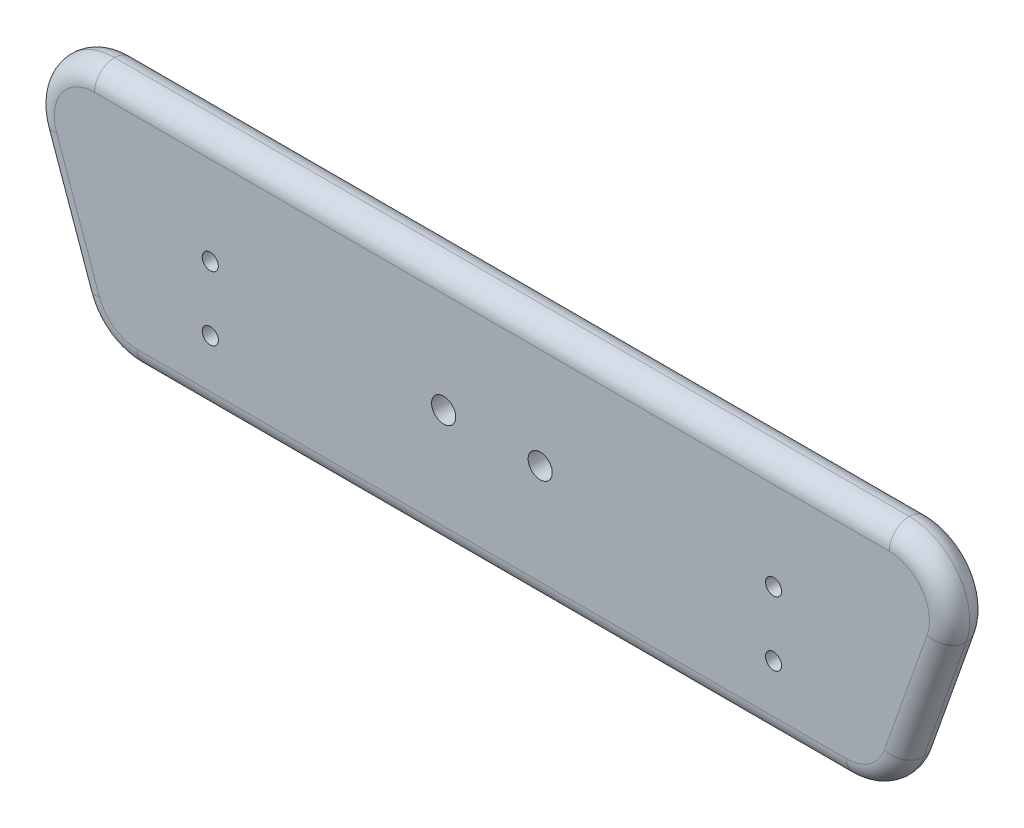
ISO-10303-21;
HEADER;
FILE_DESCRIPTION(('STEP AP214'),'2;1');
FILE_NAME('part.step','',(''),(''),'','','');
FILE_SCHEMA(('AUTOMOTIVE_DESIGN { 1 0 10303 214 1 1 1 1 }'));
ENDSEC;
DATA;
#1=APPLICATION_CONTEXT('core data for automotive mechanical design processes');
#2=APPLICATION_PROTOCOL_DEFINITION('international standard','automotive_design',2000,#1);
#3=PRODUCT_CONTEXT('',#1,'mechanical');
#4=PRODUCT('Part','Part','',(#3));
#5=PRODUCT_RELATED_PRODUCT_CATEGORY('part','',(#4));
#6=PRODUCT_DEFINITION_FORMATION('','',#4);
#7=PRODUCT_DEFINITION_CONTEXT('part definition',#1,'design');
#8=PRODUCT_DEFINITION('design','',#6,#7);
#9=PRODUCT_DEFINITION_SHAPE('','',#8);
#10=(LENGTH_UNIT() NAMED_UNIT(*) SI_UNIT(.MILLI.,.METRE.));
#11=(NAMED_UNIT(*) PLANE_ANGLE_UNIT() SI_UNIT($,.RADIAN.));
#12=(NAMED_UNIT(*) SI_UNIT($,.STERADIAN.) SOLID_ANGLE_UNIT());
#13=UNCERTAINTY_MEASURE_WITH_UNIT(LENGTH_MEASURE(1.E-05),#10,'distance_accuracy_value','');
#14=(GEOMETRIC_REPRESENTATION_CONTEXT(3) GLOBAL_UNCERTAINTY_ASSIGNED_CONTEXT((#13)) GLOBAL_UNIT_ASSIGNED_CONTEXT((#10,
#11,#12)) REPRESENTATION_CONTEXT('',''));
#15=CARTESIAN_POINT('',(0.,0.,0.));
#16=DIRECTION('',(0.,0.,1.));
#17=DIRECTION('',(1.,0.,0.));
#18=AXIS2_PLACEMENT_3D('',#15,#16,#17);
#19=CARTESIAN_POINT('',(0.,0.,10.));
#20=DIRECTION('',(0.,0.,-1.));
#21=DIRECTION('',(-1.,0.,0.));
#22=AXIS2_PLACEMENT_3D('',#19,#20,#21);
#23=PLANE('',#22);
#24=DIRECTION('',(0.333806859233775,0.942641491092177,0.));
#25=VECTOR('',#24,1.);
#26=CARTESIAN_POINT('',(97.3084687272462,-34.458736040841,10.));
#27=LINE('',#26,#25);
#28=CARTESIAN_POINT('',(93.6321603124579,-44.8403107448041,10.));
#29=VERTEX_POINT('',#28);
#30=CARTESIAN_POINT('',(104.255717488379,-14.8403107448042,10.));
#31=VERTEX_POINT('',#30);
#32=EDGE_CURVE('E239',#29,#31,#27,.T.);
#33=ORIENTED_EDGE('',*,*,#32,.T.);
#34=CARTESIAN_POINT('',(94.8293025774572,-11.5022421524664,10.));
#35=DIRECTION('',(0.,0.,-1.));
#36=DIRECTION('',(-1.,0.,0.));
#37=AXIS2_PLACEMENT_3D('',#34,#35,#36);
#38=CIRCLE('',#37,10.);
#39=CARTESIAN_POINT('',(94.8293025774572,-1.50224215246638,10.));
#40=VERTEX_POINT('',#39);
#41=EDGE_CURVE('E236',#31,#40,#38,.F.);
#42=ORIENTED_EDGE('',*,*,#41,.T.);
#43=DIRECTION('',(-1.,0.,0.));
#44=VECTOR('',#43,1.);
#45=CARTESIAN_POINT('',(0.,-1.50224215246638,10.));
#46=LINE('',#45,#44);
#47=CARTESIAN_POINT('',(-102.721679259072,-1.50224215246638,10.));
#48=VERTEX_POINT('',#47);
#49=EDGE_CURVE('E163',#40,#48,#46,.T.);
#50=ORIENTED_EDGE('',*,*,#49,.T.);
#51=CARTESIAN_POINT('',(-102.721679259072,-11.5022421524664,10.));
#52=DIRECTION('',(0.,0.,-1.));
#53=DIRECTION('',(-1.,0.,0.));
#54=AXIS2_PLACEMENT_3D('',#51,#52,#53);
#55=CIRCLE('',#54,10.);
#56=CARTESIAN_POINT('',(-112.148094169994,-14.8403107448041,10.));
#57=VERTEX_POINT('',#56);
#58=EDGE_CURVE('E165',#48,#57,#55,.F.);
#59=ORIENTED_EDGE('',*,*,#58,.T.);
#60=DIRECTION('',(0.333806859233768,-0.942641491092179,0.));
#61=VECTOR('',#60,1.);
#62=CARTESIAN_POINT('',(-104.321421400261,-36.9421528306335,10.));
#63=LINE('',#62,#61);
#64=CARTESIAN_POINT('',(-101.524536994073,-44.8403107448041,10.));
#65=VERTEX_POINT('',#64);
#66=EDGE_CURVE('E247',#57,#65,#63,.T.);
#67=ORIENTED_EDGE('',*,*,#66,.T.);
#68=CARTESIAN_POINT('',(-92.098122083151,-41.5022421524664,10.));
#69=DIRECTION('',(0.,0.,-1.));
#70=DIRECTION('',(-1.,0.,0.));
#71=AXIS2_PLACEMENT_3D('',#68,#69,#70);
#72=CIRCLE('',#71,10.);
#73=CARTESIAN_POINT('',(-92.098122083151,-51.5022421524664,10.));
#74=VERTEX_POINT('',#73);
#75=EDGE_CURVE('E245',#65,#74,#72,.F.);
#76=ORIENTED_EDGE('',*,*,#75,.T.);
#77=DIRECTION('',(1.,0.,0.));
#78=VECTOR('',#77,1.);
#79=CARTESIAN_POINT('',(0.,-51.5022421524664,10.));
#80=LINE('',#79,#78);
#81=CARTESIAN_POINT('',(84.2057454015362,-51.5022421524664,10.));
#82=VERTEX_POINT('',#81);
#83=EDGE_CURVE('E243',#74,#82,#80,.T.);
#84=ORIENTED_EDGE('',*,*,#83,.T.);
#85=CARTESIAN_POINT('',(84.2057454015362,-41.5022421524664,10.));
#86=DIRECTION('',(0.,0.,-1.));
#87=DIRECTION('',(-1.,0.,0.));
#88=AXIS2_PLACEMENT_3D('',#85,#86,#87);
#89=CIRCLE('',#88,10.);
#90=EDGE_CURVE('E241',#82,#29,#89,.F.);
#91=ORIENTED_EDGE('',*,*,#90,.T.);
#92=EDGE_LOOP('',(#33,#42,#50,#59,#67,#76,#84,#91));
#93=FACE_BOUND('',#92,.T.);
#94=CARTESIAN_POINT('',(-73.9461883408073,-23.5022421524664,10.));
#95=DIRECTION('',(0.,0.,1.));
#96=DIRECTION('',(1.,0.,0.));
#97=AXIS2_PLACEMENT_3D('',#94,#95,#96);
#98=CIRCLE('',#97,2.);
#99=CARTESIAN_POINT('',(-71.9461883408073,-23.5022421524664,10.));
#100=VERTEX_POINT('',#99);
#101=EDGE_CURVE('E250',#100,#100,#98,.T.);
#102=ORIENTED_EDGE('',*,*,#101,.F.);
#103=EDGE_LOOP('',(#102));
#104=FACE_BOUND('',#103,.T.);
#105=CARTESIAN_POINT('',(-73.9461883408073,-39.5022421524664,10.));
#106=DIRECTION('',(0.,0.,1.));
#107=DIRECTION('',(1.,0.,0.));
#108=AXIS2_PLACEMENT_3D('',#105,#106,#107);
#109=CIRCLE('',#108,2.);
#110=CARTESIAN_POINT('',(-71.9461883408073,-39.5022421524664,10.));
#111=VERTEX_POINT('',#110);
#112=EDGE_CURVE('E269',#111,#111,#109,.T.);
#113=ORIENTED_EDGE('',*,*,#112,.F.);
#114=EDGE_LOOP('',(#113));
#115=FACE_BOUND('',#114,.T.);
#116=CARTESIAN_POINT('',(66.0538116591926,-39.5022421524665,10.));
#117=DIRECTION('',(0.,0.,1.));
#118=DIRECTION('',(-1.,0.,0.));
#119=AXIS2_PLACEMENT_3D('',#116,#117,#118);
#120=CIRCLE('',#119,2.);
#121=CARTESIAN_POINT('',(64.0538116591926,-39.5022421524665,10.));
#122=VERTEX_POINT('',#121);
#123=EDGE_CURVE('E263',#122,#122,#120,.T.);
#124=ORIENTED_EDGE('',*,*,#123,.F.);
#125=EDGE_LOOP('',(#124));
#126=FACE_BOUND('',#125,.T.);
#127=CARTESIAN_POINT('',(66.0538116591927,-23.5022421524665,10.));
#128=DIRECTION('',(0.,0.,1.));
#129=DIRECTION('',(-1.,0.,0.));
#130=AXIS2_PLACEMENT_3D('',#127,#128,#129);
#131=CIRCLE('',#130,2.);
#132=CARTESIAN_POINT('',(64.0538116591927,-23.5022421524665,10.));
#133=VERTEX_POINT('',#132);
#134=EDGE_CURVE('E256',#133,#133,#131,.T.);
#135=ORIENTED_EDGE('',*,*,#134,.F.);
#136=EDGE_LOOP('',(#135));
#137=FACE_BOUND('',#136,.T.);
#138=CARTESIAN_POINT('',(8.05381165919268,-26.5022421524664,10.));
#139=DIRECTION('',(0.,0.,1.));
#140=DIRECTION('',(1.,0.,0.));
#141=AXIS2_PLACEMENT_3D('',#138,#139,#140);
#142=CIRCLE('',#141,3.);
#143=CARTESIAN_POINT('',(11.0538116591927,-26.5022421524664,10.));
#144=VERTEX_POINT('',#143);
#145=EDGE_CURVE('E306',#144,#144,#142,.T.);
#146=ORIENTED_EDGE('',*,*,#145,.F.);
#147=EDGE_LOOP('',(#146));
#148=FACE_BOUND('',#147,.T.);
#149=CARTESIAN_POINT('',(-15.9461883408073,-26.5022421524664,10.));
#150=DIRECTION('',(0.,0.,-1.));
#151=DIRECTION('',(-1.,0.,0.));
#152=AXIS2_PLACEMENT_3D('',#149,#150,#151);
#153=CIRCLE('',#152,3.);
#154=CARTESIAN_POINT('',(-18.9461883408073,-26.5022421524664,10.));
#155=VERTEX_POINT('',#154);
#156=EDGE_CURVE('E295',#155,#155,#153,.T.);
#157=ORIENTED_EDGE('',*,*,#156,.T.);
#158=EDGE_LOOP('',(#157));
#159=FACE_BOUND('',#158,.T.);
#160=ADVANCED_FACE('F38',(#93,#104,#115,#126,#137,#148,#159),#23,.F.);
#161=CARTESIAN_POINT('',(0.,0.,4.));
#162=DIRECTION('',(0.,0.,-1.));
#163=DIRECTION('',(-1.,0.,0.));
#164=AXIS2_PLACEMENT_3D('',#161,#162,#163);
#165=PLANE('',#164);
#166=CARTESIAN_POINT('',(8.05381165919268,-26.5022421524664,4.));
#167=DIRECTION('',(0.,0.,1.));
#168=DIRECTION('',(1.,0.,0.));
#169=AXIS2_PLACEMENT_3D('',#166,#167,#168);
#170=CIRCLE('',#169,3.);
#171=CARTESIAN_POINT('',(11.0538116591927,-26.5022421524664,4.));
#172=VERTEX_POINT('',#171);
#173=EDGE_CURVE('E309',#172,#172,#170,.T.);
#174=ORIENTED_EDGE('',*,*,#173,.T.);
#175=EDGE_LOOP('',(#174));
#176=FACE_BOUND('',#175,.T.);
#177=DIRECTION('',(-1.,0.,0.));
#178=VECTOR('',#177,1.);
#179=CARTESIAN_POINT('',(19.0538116591927,-6.50224215246637,4.));
#180=LINE('',#179,#178);
#181=CARTESIAN_POINT('',(19.0538116591927,-6.50224215246637,4.));
#182=VERTEX_POINT('',#181);
#183=CARTESIAN_POINT('',(-26.9461883408073,-6.50224215246637,4.));
#184=VERTEX_POINT('',#183);
#185=EDGE_CURVE('E287',#182,#184,#180,.T.);
#186=ORIENTED_EDGE('',*,*,#185,.F.);
#187=DIRECTION('',(0.,1.,0.));
#188=VECTOR('',#187,1.);
#189=CARTESIAN_POINT('',(19.0538116591927,-46.5022421524664,4.));
#190=LINE('',#189,#188);
#191=CARTESIAN_POINT('',(19.0538116591927,-46.5022421524664,4.));
#192=VERTEX_POINT('',#191);
#193=EDGE_CURVE('E283',#192,#182,#190,.T.);
#194=ORIENTED_EDGE('',*,*,#193,.F.);
#195=DIRECTION('',(-1.,0.,0.));
#196=VECTOR('',#195,1.);
#197=CARTESIAN_POINT('',(19.0538116591927,-46.5022421524664,4.));
#198=LINE('',#197,#196);
#199=CARTESIAN_POINT('',(-26.9461883408073,-46.5022421524664,4.));
#200=VERTEX_POINT('',#199);
#201=EDGE_CURVE('E298',#192,#200,#198,.T.);
#202=ORIENTED_EDGE('',*,*,#201,.T.);
#203=DIRECTION('',(0.,1.,0.));
#204=VECTOR('',#203,1.);
#205=CARTESIAN_POINT('',(-26.9461883408073,-46.5022421524664,4.));
#206=LINE('',#205,#204);
#207=EDGE_CURVE('E301',#200,#184,#206,.T.);
#208=ORIENTED_EDGE('',*,*,#207,.T.);
#209=EDGE_LOOP('',(#186,#194,#202,#208));
#210=FACE_BOUND('',#209,.T.);
#211=CARTESIAN_POINT('',(-15.9461883408073,-26.5022421524664,4.));
#212=DIRECTION('',(0.,0.,-1.));
#213=DIRECTION('',(-1.,0.,0.));
#214=AXIS2_PLACEMENT_3D('',#211,#212,#213);
#215=CIRCLE('',#214,3.);
#216=CARTESIAN_POINT('',(-18.9461883408073,-26.5022421524664,4.));
#217=VERTEX_POINT('',#216);
#218=EDGE_CURVE('E312',#217,#217,#215,.T.);
#219=ORIENTED_EDGE('',*,*,#218,.F.);
#220=EDGE_LOOP('',(#219));
#221=FACE_BOUND('',#220,.T.);
#222=ADVANCED_FACE('F326',(#176,#210,#221),#165,.T.);
#223=CARTESIAN_POINT('',(0.,0.,0.));
#224=DIRECTION('',(0.,0.,-1.));
#225=DIRECTION('',(-1.,0.,0.));
#226=AXIS2_PLACEMENT_3D('',#223,#224,#225);
#227=PLANE('',#226);
#228=DIRECTION('',(0.333806859233768,-0.942641491092179,0.));
#229=VECTOR('',#228,1.);
#230=CARTESIAN_POINT('',(-112.148094169994,-14.8403107448041,0.));
#231=LINE('',#230,#229);
#232=CARTESIAN_POINT('',(-101.524536994073,-44.8403107448041,0.));
#233=VERTEX_POINT('',#232);
#234=CARTESIAN_POINT('',(-112.148094169994,-14.8403107448041,0.));
#235=VERTEX_POINT('',#234);
#236=EDGE_CURVE('E47',#233,#235,#231,.F.);
#237=ORIENTED_EDGE('',*,*,#236,.T.);
#238=CARTESIAN_POINT('',(-102.721679259072,-11.5022421524664,0.));
#239=DIRECTION('',(0.,0.,-1.));
#240=DIRECTION('',(-1.,0.,0.));
#241=AXIS2_PLACEMENT_3D('',#238,#239,#240);
#242=CIRCLE('',#241,10.);
#243=CARTESIAN_POINT('',(-102.721679259072,-1.50224215246638,0.));
#244=VERTEX_POINT('',#243);
#245=EDGE_CURVE('E11',#235,#244,#242,.T.);
#246=ORIENTED_EDGE('',*,*,#245,.T.);
#247=DIRECTION('',(-1.,0.,0.));
#248=VECTOR('',#247,1.);
#249=CARTESIAN_POINT('',(94.8293025774572,-1.50224215246638,0.));
#250=LINE('',#249,#248);
#251=CARTESIAN_POINT('',(94.8293025774572,-1.50224215246638,0.));
#252=VERTEX_POINT('',#251);
#253=EDGE_CURVE('E234',#244,#252,#250,.F.);
#254=ORIENTED_EDGE('',*,*,#253,.T.);
#255=CARTESIAN_POINT('',(94.8293025774572,-11.5022421524664,0.));
#256=DIRECTION('',(0.,0.,-1.));
#257=DIRECTION('',(-1.,0.,0.));
#258=AXIS2_PLACEMENT_3D('',#255,#256,#257);
#259=CIRCLE('',#258,10.);
#260=CARTESIAN_POINT('',(104.255717488379,-14.8403107448041,0.));
#261=VERTEX_POINT('',#260);
#262=EDGE_CURVE('E232',#252,#261,#259,.T.);
#263=ORIENTED_EDGE('',*,*,#262,.T.);
#264=DIRECTION('',(0.333806859233775,0.942641491092177,0.));
#265=VECTOR('',#264,1.);
#266=CARTESIAN_POINT('',(93.6321603124579,-44.8403107448041,0.));
#267=LINE('',#266,#265);
#268=CARTESIAN_POINT('',(93.6321603124579,-44.8403107448041,0.));
#269=VERTEX_POINT('',#268);
#270=EDGE_CURVE('E230',#261,#269,#267,.F.);
#271=ORIENTED_EDGE('',*,*,#270,.T.);
#272=CARTESIAN_POINT('',(84.2057454015362,-41.5022421524664,0.));
#273=DIRECTION('',(0.,0.,-1.));
#274=DIRECTION('',(-1.,0.,0.));
#275=AXIS2_PLACEMENT_3D('',#272,#273,#274);
#276=CIRCLE('',#275,10.);
#277=CARTESIAN_POINT('',(84.2057454015362,-51.5022421524664,0.));
#278=VERTEX_POINT('',#277);
#279=EDGE_CURVE('E151',#269,#278,#276,.T.);
#280=ORIENTED_EDGE('',*,*,#279,.T.);
#281=DIRECTION('',(1.,0.,0.));
#282=VECTOR('',#281,1.);
#283=CARTESIAN_POINT('',(-92.098122083151,-51.5022421524664,0.));
#284=LINE('',#283,#282);
#285=CARTESIAN_POINT('',(-92.098122083151,-51.5022421524664,0.));
#286=VERTEX_POINT('',#285);
#287=EDGE_CURVE('E145',#278,#286,#284,.F.);
#288=ORIENTED_EDGE('',*,*,#287,.T.);
#289=CARTESIAN_POINT('',(-92.098122083151,-41.5022421524664,0.));
#290=DIRECTION('',(0.,0.,-1.));
#291=DIRECTION('',(-1.,0.,0.));
#292=AXIS2_PLACEMENT_3D('',#289,#290,#291);
#293=CIRCLE('',#292,10.);
#294=EDGE_CURVE('E148',#286,#233,#293,.T.);
#295=ORIENTED_EDGE('',*,*,#294,.T.);
#296=EDGE_LOOP('',(#237,#246,#254,#263,#271,#280,#288,#295));
#297=FACE_BOUND('',#296,.T.);
#298=DIRECTION('',(0.,1.,0.));
#299=VECTOR('',#298,1.);
#300=CARTESIAN_POINT('',(19.0538116591927,-46.5022421524664,0.));
#301=LINE('',#300,#299);
#302=CARTESIAN_POINT('',(19.0538116591927,-46.5022421524664,0.));
#303=VERTEX_POINT('',#302);
#304=CARTESIAN_POINT('',(19.0538116591927,-6.50224215246637,0.));
#305=VERTEX_POINT('',#304);
#306=EDGE_CURVE('E284',#303,#305,#301,.T.);
#307=ORIENTED_EDGE('',*,*,#306,.T.);
#308=DIRECTION('',(-1.,0.,0.));
#309=VECTOR('',#308,1.);
#310=CARTESIAN_POINT('',(19.0538116591927,-6.50224215246637,0.));
#311=LINE('',#310,#309);
#312=CARTESIAN_POINT('',(-26.9461883408073,-6.50224215246637,0.));
#313=VERTEX_POINT('',#312);
#314=EDGE_CURVE('E55',#305,#313,#311,.T.);
#315=ORIENTED_EDGE('',*,*,#314,.T.);
#316=DIRECTION('',(0.,1.,0.));
#317=VECTOR('',#316,1.);
#318=CARTESIAN_POINT('',(-26.9461883408073,-46.5022421524664,0.));
#319=LINE('',#318,#317);
#320=CARTESIAN_POINT('',(-26.9461883408073,-46.5022421524664,0.));
#321=VERTEX_POINT('',#320);
#322=EDGE_CURVE('E291',#321,#313,#319,.T.);
#323=ORIENTED_EDGE('',*,*,#322,.F.);
#324=DIRECTION('',(-1.,0.,0.));
#325=VECTOR('',#324,1.);
#326=CARTESIAN_POINT('',(19.0538116591927,-46.5022421524664,0.));
#327=LINE('',#326,#325);
#328=EDGE_CURVE('E288',#303,#321,#327,.T.);
#329=ORIENTED_EDGE('',*,*,#328,.F.);
#330=EDGE_LOOP('',(#307,#315,#323,#329));
#331=FACE_BOUND('',#330,.T.);
#332=ADVANCED_FACE('F146',(#297,#331),#227,.T.);
#333=CARTESIAN_POINT('',(-92.098122083151,-41.5022421524664,5.));
#334=DIRECTION('',(0.,0.,-1.));
#335=DIRECTION('',(-1.,0.,0.));
#336=AXIS2_PLACEMENT_3D('',#333,#334,#335);
#337=TOROIDAL_SURFACE('',#336,10.,5.);
#338=CARTESIAN_POINT('',(-101.524536994073,-44.8403107448041,5.));
#339=DIRECTION('',(-0.333806859233768,0.94264149109218,0.));
#340=DIRECTION('',(-0.94264149109218,-0.333806859233768,0.));
#341=AXIS2_PLACEMENT_3D('',#338,#339,#340);
#342=CIRCLE('',#341,5.);
#343=CARTESIAN_POINT('',(-106.237744449534,-46.5093450409729,5.));
#344=VERTEX_POINT('',#343);
#345=EDGE_CURVE('E156',#233,#344,#342,.T.);
#346=ORIENTED_EDGE('',*,*,#345,.F.);
#347=ORIENTED_EDGE('',*,*,#294,.F.);
#348=CARTESIAN_POINT('',(-92.098122083151,-51.5022421524664,5.));
#349=DIRECTION('',(1.,0.,0.));
#350=DIRECTION('',(0.,0.,-1.));
#351=AXIS2_PLACEMENT_3D('',#348,#349,#350);
#352=CIRCLE('',#351,5.);
#353=CARTESIAN_POINT('',(-92.098122083151,-56.5022421524664,5.));
#354=VERTEX_POINT('',#353);
#355=EDGE_CURVE('E42',#354,#286,#352,.T.);
#356=ORIENTED_EDGE('',*,*,#355,.F.);
#357=CARTESIAN_POINT('',(-92.098122083151,-41.5022421524664,5.));
#358=DIRECTION('',(0.,0.,-1.));
#359=DIRECTION('',(-1.,0.,0.));
#360=AXIS2_PLACEMENT_3D('',#357,#358,#359);
#361=CIRCLE('',#360,15.);
#362=EDGE_CURVE('E164',#344,#354,#361,.F.);
#363=ORIENTED_EDGE('',*,*,#362,.F.);
#364=EDGE_LOOP('',(#346,#347,#356,#363));
#365=FACE_BOUND('',#364,.T.);
#366=ADVANCED_FACE('F40',(#365),#337,.T.);
#367=CARTESIAN_POINT('',(-102.699073988966,-51.5022421524664,5.));
#368=DIRECTION('',(-1.,0.,0.));
#369=DIRECTION('',(0.,-1.,0.));
#370=AXIS2_PLACEMENT_3D('',#367,#368,#369);
#371=CYLINDRICAL_SURFACE('',#370,5.);
#372=ORIENTED_EDGE('',*,*,#355,.T.);
#373=ORIENTED_EDGE('',*,*,#287,.F.);
#374=CARTESIAN_POINT('',(84.2057454015362,-51.5022421524664,5.));
#375=DIRECTION('',(1.,0.,0.));
#376=DIRECTION('',(0.,0.,-1.));
#377=AXIS2_PLACEMENT_3D('',#374,#375,#376);
#378=CIRCLE('',#377,5.);
#379=CARTESIAN_POINT('',(84.2057454015362,-56.5022421524664,5.));
#380=VERTEX_POINT('',#379);
#381=EDGE_CURVE('E170',#380,#278,#378,.T.);
#382=ORIENTED_EDGE('',*,*,#381,.F.);
#383=DIRECTION('',(1.,0.,0.));
#384=VECTOR('',#383,1.);
#385=CARTESIAN_POINT('',(84.2057454015361,-56.5022421524664,5.));
#386=LINE('',#385,#384);
#387=EDGE_CURVE('E161',#354,#380,#386,.T.);
#388=ORIENTED_EDGE('',*,*,#387,.F.);
#389=EDGE_LOOP('',(#372,#373,#382,#388));
#390=FACE_BOUND('',#389,.T.);
#391=ADVANCED_FACE('F159',(#390),#371,.T.);
#392=CARTESIAN_POINT('',(-92.098122083151,-41.5022421524664,5.));
#393=DIRECTION('',(0.,0.,-1.));
#394=DIRECTION('',(-1.,0.,0.));
#395=AXIS2_PLACEMENT_3D('',#392,#393,#394);
#396=TOROIDAL_SURFACE('',#395,10.,5.);
#397=CARTESIAN_POINT('',(-101.524536994073,-44.8403107448041,5.));
#398=DIRECTION('',(-0.333806859233768,0.94264149109218,0.));
#399=DIRECTION('',(-0.94264149109218,-0.333806859233768,0.));
#400=AXIS2_PLACEMENT_3D('',#397,#398,#399);
#401=CIRCLE('',#400,5.);
#402=EDGE_CURVE('E177',#344,#65,#401,.T.);
#403=ORIENTED_EDGE('',*,*,#402,.F.);
#404=ORIENTED_EDGE('',*,*,#362,.T.);
#405=CARTESIAN_POINT('',(-92.098122083151,-51.5022421524664,5.));
#406=DIRECTION('',(1.,0.,0.));
#407=DIRECTION('',(0.,0.,-1.));
#408=AXIS2_PLACEMENT_3D('',#405,#406,#407);
#409=CIRCLE('',#408,5.);
#410=EDGE_CURVE('E175',#74,#354,#409,.T.);
#411=ORIENTED_EDGE('',*,*,#410,.F.);
#412=ORIENTED_EDGE('',*,*,#75,.F.);
#413=EDGE_LOOP('',(#403,#404,#411,#412));
#414=FACE_BOUND('',#413,.T.);
#415=ADVANCED_FACE('F437',(#414),#396,.T.);
#416=CARTESIAN_POINT('',(-119.232980885346,5.16679214370246,5.));
#417=DIRECTION('',(-0.333806859233768,0.942641491092179,0.));
#418=DIRECTION('',(-0.942641491092179,-0.333806859233768,0.));
#419=AXIS2_PLACEMENT_3D('',#416,#417,#418);
#420=CYLINDRICAL_SURFACE('',#419,5.);
#421=ORIENTED_EDGE('',*,*,#236,.F.);
#422=ORIENTED_EDGE('',*,*,#345,.T.);
#423=DIRECTION('',(0.333806859233768,-0.942641491092179,0.));
#424=VECTOR('',#423,1.);
#425=CARTESIAN_POINT('',(-106.237744449534,-46.5093450409729,5.));
#426=LINE('',#425,#424);
#427=CARTESIAN_POINT('',(-116.861301625455,-16.5093450409729,5.));
#428=VERTEX_POINT('',#427);
#429=EDGE_CURVE('E180',#428,#344,#426,.T.);
#430=ORIENTED_EDGE('',*,*,#429,.F.);
#431=CARTESIAN_POINT('',(-112.148094169994,-14.8403107448041,5.));
#432=DIRECTION('',(-0.333806859233768,0.94264149109218,0.));
#433=DIRECTION('',(-0.94264149109218,-0.333806859233768,0.));
#434=AXIS2_PLACEMENT_3D('',#431,#432,#433);
#435=CIRCLE('',#434,5.);
#436=EDGE_CURVE('E183',#235,#428,#435,.T.);
#437=ORIENTED_EDGE('',*,*,#436,.F.);
#438=EDGE_LOOP('',(#421,#422,#430,#437));
#439=FACE_BOUND('',#438,.T.);
#440=ADVANCED_FACE('F433',(#439),#420,.T.);
#441=CARTESIAN_POINT('',(84.2057454015362,-41.5022421524664,5.));
#442=DIRECTION('',(0.,0.,-1.));
#443=DIRECTION('',(-1.,0.,0.));
#444=AXIS2_PLACEMENT_3D('',#441,#442,#443);
#445=TOROIDAL_SURFACE('',#444,10.,5.);
#446=ORIENTED_EDGE('',*,*,#381,.T.);
#447=ORIENTED_EDGE('',*,*,#279,.F.);
#448=CARTESIAN_POINT('',(93.6321603124579,-44.8403107448041,5.));
#449=DIRECTION('',(0.333806859233776,0.942641491092177,0.));
#450=DIRECTION('',(-0.942641491092177,0.333806859233776,0.));
#451=AXIS2_PLACEMENT_3D('',#448,#449,#450);
#452=CIRCLE('',#451,5.);
#453=CARTESIAN_POINT('',(98.3453677679188,-46.509345040973,5.));
#454=VERTEX_POINT('',#453);
#455=EDGE_CURVE('E186',#454,#269,#452,.T.);
#456=ORIENTED_EDGE('',*,*,#455,.F.);
#457=CARTESIAN_POINT('',(84.2057454015362,-41.5022421524664,5.));
#458=DIRECTION('',(0.,0.,-1.));
#459=DIRECTION('',(-1.,0.,0.));
#460=AXIS2_PLACEMENT_3D('',#457,#458,#459);
#461=CIRCLE('',#460,15.);
#462=EDGE_CURVE('E189',#380,#454,#461,.F.);
#463=ORIENTED_EDGE('',*,*,#462,.F.);
#464=EDGE_LOOP('',(#446,#447,#456,#463));
#465=FACE_BOUND('',#464,.T.);
#466=ADVANCED_FACE('F429',(#465),#445,.T.);
#467=CARTESIAN_POINT('',(0.,-51.5022421524664,5.));
#468=DIRECTION('',(1.,0.,0.));
#469=DIRECTION('',(0.,1.,0.));
#470=AXIS2_PLACEMENT_3D('',#467,#468,#469);
#471=CYLINDRICAL_SURFACE('',#470,5.);
#472=ORIENTED_EDGE('',*,*,#410,.T.);
#473=ORIENTED_EDGE('',*,*,#387,.T.);
#474=CARTESIAN_POINT('',(84.2057454015362,-51.5022421524664,5.));
#475=DIRECTION('',(1.,0.,0.));
#476=DIRECTION('',(0.,0.,-1.));
#477=AXIS2_PLACEMENT_3D('',#474,#475,#476);
#478=CIRCLE('',#477,5.);
#479=EDGE_CURVE('E192',#82,#380,#478,.T.);
#480=ORIENTED_EDGE('',*,*,#479,.F.);
#481=ORIENTED_EDGE('',*,*,#83,.F.);
#482=EDGE_LOOP('',(#472,#473,#480,#481));
#483=FACE_BOUND('',#482,.T.);
#484=ADVANCED_FACE('F425',(#483),#471,.T.);
#485=CARTESIAN_POINT('',(-104.321421400261,-36.9421528306335,5.));
#486=DIRECTION('',(0.333806859233768,-0.942641491092179,0.));
#487=DIRECTION('',(0.942641491092179,0.333806859233768,0.));
#488=AXIS2_PLACEMENT_3D('',#485,#486,#487);
#489=CYLINDRICAL_SURFACE('',#488,5.);
#490=ORIENTED_EDGE('',*,*,#402,.T.);
#491=ORIENTED_EDGE('',*,*,#66,.F.);
#492=CARTESIAN_POINT('',(-112.148094169994,-14.8403107448041,5.));
#493=DIRECTION('',(-0.333806859233768,0.942641491092179,0.));
#494=DIRECTION('',(-0.942641491092179,-0.333806859233768,0.));
#495=AXIS2_PLACEMENT_3D('',#492,#493,#494);
#496=CIRCLE('',#495,5.);
#497=EDGE_CURVE('E195',#428,#57,#496,.T.);
#498=ORIENTED_EDGE('',*,*,#497,.F.);
#499=ORIENTED_EDGE('',*,*,#429,.T.);
#500=EDGE_LOOP('',(#490,#491,#498,#499));
#501=FACE_BOUND('',#500,.T.);
#502=ADVANCED_FACE('F421',(#501),#489,.T.);
#503=CARTESIAN_POINT('',(-102.721679259072,-11.5022421524664,5.));
#504=DIRECTION('',(0.,0.,-1.));
#505=DIRECTION('',(-1.,0.,0.));
#506=AXIS2_PLACEMENT_3D('',#503,#504,#505);
#507=TOROIDAL_SURFACE('',#506,10.,5.);
#508=ORIENTED_EDGE('',*,*,#245,.F.);
#509=ORIENTED_EDGE('',*,*,#436,.T.);
#510=CARTESIAN_POINT('',(-102.721679259072,-11.5022421524664,5.));
#511=DIRECTION('',(0.,0.,-1.));
#512=DIRECTION('',(-1.,0.,0.));
#513=AXIS2_PLACEMENT_3D('',#510,#511,#512);
#514=CIRCLE('',#513,15.);
#515=CARTESIAN_POINT('',(-102.721679259072,3.49775784753362,5.));
#516=VERTEX_POINT('',#515);
#517=EDGE_CURVE('E198',#516,#428,#514,.F.);
#518=ORIENTED_EDGE('',*,*,#517,.F.);
#519=CARTESIAN_POINT('',(-102.721679259072,-1.50224215246638,5.));
#520=DIRECTION('',(1.,0.,0.));
#521=DIRECTION('',(0.,0.,-1.));
#522=AXIS2_PLACEMENT_3D('',#519,#520,#521);
#523=CIRCLE('',#522,5.);
#524=EDGE_CURVE('E201',#244,#516,#523,.T.);
#525=ORIENTED_EDGE('',*,*,#524,.F.);
#526=EDGE_LOOP('',(#508,#509,#518,#525));
#527=FACE_BOUND('',#526,.T.);
#528=ADVANCED_FACE('F417',(#527),#507,.T.);
#529=CARTESIAN_POINT('',(111.340604203732,5.16679214370249,5.));
#530=DIRECTION('',(-0.333806859233775,-0.942641491092177,0.));
#531=DIRECTION('',(0.942641491092177,-0.333806859233775,0.));
#532=AXIS2_PLACEMENT_3D('',#529,#530,#531);
#533=CYLINDRICAL_SURFACE('',#532,5.);
#534=ORIENTED_EDGE('',*,*,#455,.T.);
#535=ORIENTED_EDGE('',*,*,#270,.F.);
#536=CARTESIAN_POINT('',(104.255717488379,-14.8403107448041,5.));
#537=DIRECTION('',(0.333806859233775,0.942641491092177,0.));
#538=DIRECTION('',(-0.942641491092177,0.333806859233775,0.));
#539=AXIS2_PLACEMENT_3D('',#536,#537,#538);
#540=CIRCLE('',#539,5.);
#541=CARTESIAN_POINT('',(108.96892494384,-16.509345040973,5.));
#542=VERTEX_POINT('',#541);
#543=EDGE_CURVE('E206',#542,#261,#540,.T.);
#544=ORIENTED_EDGE('',*,*,#543,.F.);
#545=DIRECTION('',(0.333806859233775,0.942641491092177,0.));
#546=VECTOR('',#545,1.);
#547=CARTESIAN_POINT('',(108.96892494384,-16.509345040973,5.));
#548=LINE('',#547,#546);
#549=EDGE_CURVE('E209',#454,#542,#548,.T.);
#550=ORIENTED_EDGE('',*,*,#549,.F.);
#551=EDGE_LOOP('',(#534,#535,#544,#550));
#552=FACE_BOUND('',#551,.T.);
#553=ADVANCED_FACE('F413',(#552),#533,.T.);
#554=CARTESIAN_POINT('',(84.2057454015362,-41.5022421524664,5.));
#555=DIRECTION('',(0.,0.,-1.));
#556=DIRECTION('',(-1.,0.,0.));
#557=AXIS2_PLACEMENT_3D('',#554,#555,#556);
#558=TOROIDAL_SURFACE('',#557,10.,5.);
#559=ORIENTED_EDGE('',*,*,#479,.T.);
#560=ORIENTED_EDGE('',*,*,#462,.T.);
#561=CARTESIAN_POINT('',(93.6321603124579,-44.8403107448041,5.));
#562=DIRECTION('',(0.333806859233775,0.942641491092177,0.));
#563=DIRECTION('',(-0.942641491092177,0.333806859233775,0.));
#564=AXIS2_PLACEMENT_3D('',#561,#562,#563);
#565=CIRCLE('',#564,5.);
#566=EDGE_CURVE('E212',#29,#454,#565,.T.);
#567=ORIENTED_EDGE('',*,*,#566,.F.);
#568=ORIENTED_EDGE('',*,*,#90,.F.);
#569=EDGE_LOOP('',(#559,#560,#567,#568));
#570=FACE_BOUND('',#569,.T.);
#571=ADVANCED_FACE('F409',(#570),#558,.T.);
#572=CARTESIAN_POINT('',(-102.721679259072,-11.5022421524664,5.));
#573=DIRECTION('',(0.,0.,-1.));
#574=DIRECTION('',(-1.,0.,0.));
#575=AXIS2_PLACEMENT_3D('',#572,#573,#574);
#576=TOROIDAL_SURFACE('',#575,10.,5.);
#577=ORIENTED_EDGE('',*,*,#497,.T.);
#578=ORIENTED_EDGE('',*,*,#58,.F.);
#579=CARTESIAN_POINT('',(-102.721679259072,-1.50224215246638,5.));
#580=DIRECTION('',(1.,0.,0.));
#581=DIRECTION('',(0.,0.,-1.));
#582=AXIS2_PLACEMENT_3D('',#579,#580,#581);
#583=CIRCLE('',#582,5.);
#584=EDGE_CURVE('E215',#516,#48,#583,.T.);
#585=ORIENTED_EDGE('',*,*,#584,.F.);
#586=ORIENTED_EDGE('',*,*,#517,.T.);
#587=EDGE_LOOP('',(#577,#578,#585,#586));
#588=FACE_BOUND('',#587,.T.);
#589=ADVANCED_FACE('F405',(#588),#576,.T.);
#590=CARTESIAN_POINT('',(-123.946188340807,-1.50224215246638,5.));
#591=DIRECTION('',(1.,0.,0.));
#592=DIRECTION('',(0.,0.,-1.));
#593=AXIS2_PLACEMENT_3D('',#590,#591,#592);
#594=CYLINDRICAL_SURFACE('',#593,5.);
#595=CARTESIAN_POINT('',(94.8293025774572,-1.50224215246638,5.));
#596=DIRECTION('',(1.,0.,0.));
#597=DIRECTION('',(0.,0.,-1.));
#598=AXIS2_PLACEMENT_3D('',#595,#596,#597);
#599=CIRCLE('',#598,5.);
#600=CARTESIAN_POINT('',(94.8293025774572,3.49775784753362,5.));
#601=VERTEX_POINT('',#600);
#602=EDGE_CURVE('E204',#252,#601,#599,.T.);
#603=ORIENTED_EDGE('',*,*,#602,.F.);
#604=ORIENTED_EDGE('',*,*,#253,.F.);
#605=ORIENTED_EDGE('',*,*,#524,.T.);
#606=DIRECTION('',(-1.,0.,0.));
#607=VECTOR('',#606,1.);
#608=CARTESIAN_POINT('',(-102.721679259072,3.49775784753362,5.));
#609=LINE('',#608,#607);
#610=EDGE_CURVE('E218',#601,#516,#609,.T.);
#611=ORIENTED_EDGE('',*,*,#610,.F.);
#612=EDGE_LOOP('',(#603,#604,#605,#611));
#613=FACE_BOUND('',#612,.T.);
#614=ADVANCED_FACE('F401',(#613),#594,.T.);
#615=CARTESIAN_POINT('',(94.8293025774572,-11.5022421524664,5.));
#616=DIRECTION('',(0.,0.,-1.));
#617=DIRECTION('',(-1.,0.,0.));
#618=AXIS2_PLACEMENT_3D('',#615,#616,#617);
#619=TOROIDAL_SURFACE('',#618,10.,5.);
#620=ORIENTED_EDGE('',*,*,#262,.F.);
#621=ORIENTED_EDGE('',*,*,#602,.T.);
#622=CARTESIAN_POINT('',(94.8293025774572,-11.5022421524664,5.));
#623=DIRECTION('',(0.,0.,-1.));
#624=DIRECTION('',(-1.,0.,0.));
#625=AXIS2_PLACEMENT_3D('',#622,#623,#624);
#626=CIRCLE('',#625,15.);
#627=EDGE_CURVE('E221',#542,#601,#626,.F.);
#628=ORIENTED_EDGE('',*,*,#627,.F.);
#629=ORIENTED_EDGE('',*,*,#543,.T.);
#630=EDGE_LOOP('',(#620,#621,#628,#629));
#631=FACE_BOUND('',#630,.T.);
#632=ADVANCED_FACE('F397',(#631),#619,.T.);
#633=CARTESIAN_POINT('',(97.3084687272462,-34.458736040841,5.));
#634=DIRECTION('',(0.333806859233775,0.942641491092177,0.));
#635=DIRECTION('',(-0.942641491092177,0.333806859233775,0.));
#636=AXIS2_PLACEMENT_3D('',#633,#634,#635);
#637=CYLINDRICAL_SURFACE('',#636,5.);
#638=ORIENTED_EDGE('',*,*,#566,.T.);
#639=ORIENTED_EDGE('',*,*,#549,.T.);
#640=CARTESIAN_POINT('',(104.255717488379,-14.8403107448042,5.));
#641=DIRECTION('',(0.333806859233775,0.942641491092177,0.));
#642=DIRECTION('',(-0.942641491092177,0.333806859233775,0.));
#643=AXIS2_PLACEMENT_3D('',#640,#641,#642);
#644=CIRCLE('',#643,5.);
#645=EDGE_CURVE('E223',#31,#542,#644,.T.);
#646=ORIENTED_EDGE('',*,*,#645,.F.);
#647=ORIENTED_EDGE('',*,*,#32,.F.);
#648=EDGE_LOOP('',(#638,#639,#646,#647));
#649=FACE_BOUND('',#648,.T.);
#650=ADVANCED_FACE('F393',(#649),#637,.T.);
#651=CARTESIAN_POINT('',(0.,-1.50224215246638,5.));
#652=DIRECTION('',(-1.,0.,0.));
#653=DIRECTION('',(0.,0.,1.));
#654=AXIS2_PLACEMENT_3D('',#651,#652,#653);
#655=CYLINDRICAL_SURFACE('',#654,5.);
#656=ORIENTED_EDGE('',*,*,#584,.T.);
#657=ORIENTED_EDGE('',*,*,#49,.F.);
#658=CARTESIAN_POINT('',(94.8293025774572,-1.50224215246638,5.));
#659=DIRECTION('',(1.,0.,0.));
#660=DIRECTION('',(0.,0.,-1.));
#661=AXIS2_PLACEMENT_3D('',#658,#659,#660);
#662=CIRCLE('',#661,5.);
#663=EDGE_CURVE('E103',#601,#40,#662,.T.);
#664=ORIENTED_EDGE('',*,*,#663,.F.);
#665=ORIENTED_EDGE('',*,*,#610,.T.);
#666=EDGE_LOOP('',(#656,#657,#664,#665));
#667=FACE_BOUND('',#666,.T.);
#668=ADVANCED_FACE('F390',(#667),#655,.T.);
#669=CARTESIAN_POINT('',(94.8293025774572,-11.5022421524664,5.));
#670=DIRECTION('',(0.,0.,-1.));
#671=DIRECTION('',(-1.,0.,0.));
#672=AXIS2_PLACEMENT_3D('',#669,#670,#671);
#673=TOROIDAL_SURFACE('',#672,10.,5.);
#674=ORIENTED_EDGE('',*,*,#645,.T.);
#675=ORIENTED_EDGE('',*,*,#627,.T.);
#676=ORIENTED_EDGE('',*,*,#663,.T.);
#677=ORIENTED_EDGE('',*,*,#41,.F.);
#678=EDGE_LOOP('',(#674,#675,#676,#677));
#679=FACE_BOUND('',#678,.T.);
#680=ADVANCED_FACE('F385',(#679),#673,.T.);
#681=CARTESIAN_POINT('',(-73.9461883408073,-23.5022421524664,2.5));
#682=DIRECTION('',(0.,0.,1.));
#683=DIRECTION('',(1.,0.,0.));
#684=AXIS2_PLACEMENT_3D('',#681,#682,#683);
#685=CYLINDRICAL_SURFACE('',#684,2.);
#686=CARTESIAN_POINT('',(-73.9461883408073,-23.5022421524664,2.5));
#687=DIRECTION('',(0.,0.,1.));
#688=DIRECTION('',(1.,0.,0.));
#689=AXIS2_PLACEMENT_3D('',#686,#687,#688);
#690=CIRCLE('',#689,2.);
#691=CARTESIAN_POINT('',(-71.9461883408073,-23.5022421524664,2.5));
#692=VERTEX_POINT('',#691);
#693=EDGE_CURVE('E226',#692,#692,#690,.T.);
#694=ORIENTED_EDGE('',*,*,#693,.F.);
#695=EDGE_LOOP('',(#694));
#696=FACE_BOUND('',#695,.T.);
#697=ORIENTED_EDGE('',*,*,#101,.T.);
#698=EDGE_LOOP('',(#697));
#699=FACE_BOUND('',#698,.T.);
#700=ADVANCED_FACE('F382',(#696,#699),#685,.F.);
#701=CARTESIAN_POINT('',(-73.9461883408073,-23.5022421524664,2.5));
#702=DIRECTION('',(0.,0.,1.));
#703=DIRECTION('',(1.,0.,0.));
#704=AXIS2_PLACEMENT_3D('',#701,#702,#703);
#705=PLANE('',#704);
#706=ORIENTED_EDGE('',*,*,#693,.T.);
#707=EDGE_LOOP('',(#706));
#708=FACE_BOUND('',#707,.T.);
#709=ADVANCED_FACE('F364',(#708),#705,.T.);
#710=CARTESIAN_POINT('',(-73.9461883408073,-39.5022421524664,2.5));
#711=DIRECTION('',(0.,0.,1.));
#712=DIRECTION('',(1.,0.,0.));
#713=AXIS2_PLACEMENT_3D('',#710,#711,#712);
#714=CYLINDRICAL_SURFACE('',#713,2.);
#715=CARTESIAN_POINT('',(-73.9461883408073,-39.5022421524664,2.5));
#716=DIRECTION('',(0.,0.,1.));
#717=DIRECTION('',(1.,0.,0.));
#718=AXIS2_PLACEMENT_3D('',#715,#716,#717);
#719=CIRCLE('',#718,2.);
#720=CARTESIAN_POINT('',(-71.9461883408073,-39.5022421524664,2.5));
#721=VERTEX_POINT('',#720);
#722=EDGE_CURVE('E253',#721,#721,#719,.T.);
#723=ORIENTED_EDGE('',*,*,#722,.F.);
#724=EDGE_LOOP('',(#723));
#725=FACE_BOUND('',#724,.T.);
#726=ORIENTED_EDGE('',*,*,#112,.T.);
#727=EDGE_LOOP('',(#726));
#728=FACE_BOUND('',#727,.T.);
#729=ADVANCED_FACE('F360',(#725,#728),#714,.F.);
#730=CARTESIAN_POINT('',(-73.9461883408073,-39.5022421524664,2.5));
#731=DIRECTION('',(0.,0.,1.));
#732=DIRECTION('',(1.,0.,0.));
#733=AXIS2_PLACEMENT_3D('',#730,#731,#732);
#734=PLANE('',#733);
#735=ORIENTED_EDGE('',*,*,#722,.T.);
#736=EDGE_LOOP('',(#735));
#737=FACE_BOUND('',#736,.T.);
#738=ADVANCED_FACE('F356',(#737),#734,.T.);
#739=CARTESIAN_POINT('',(66.0538116591926,-39.5022421524665,2.5));
#740=DIRECTION('',(0.,0.,1.));
#741=DIRECTION('',(1.,0.,0.));
#742=AXIS2_PLACEMENT_3D('',#739,#740,#741);
#743=CYLINDRICAL_SURFACE('',#742,2.);
#744=CARTESIAN_POINT('',(66.0538116591926,-39.5022421524665,2.5));
#745=DIRECTION('',(0.,0.,1.));
#746=DIRECTION('',(-1.,0.,0.));
#747=AXIS2_PLACEMENT_3D('',#744,#745,#746);
#748=CIRCLE('',#747,2.);
#749=CARTESIAN_POINT('',(64.0538116591926,-39.5022421524665,2.5));
#750=VERTEX_POINT('',#749);
#751=EDGE_CURVE('E266',#750,#750,#748,.T.);
#752=ORIENTED_EDGE('',*,*,#751,.F.);
#753=EDGE_LOOP('',(#752));
#754=FACE_BOUND('',#753,.T.);
#755=ORIENTED_EDGE('',*,*,#123,.T.);
#756=EDGE_LOOP('',(#755));
#757=FACE_BOUND('',#756,.T.);
#758=ADVANCED_FACE('F359',(#754,#757),#743,.F.);
#759=CARTESIAN_POINT('',(66.0538116591926,-39.5022421524665,2.5));
#760=DIRECTION('',(0.,0.,-1.));
#761=DIRECTION('',(-1.,0.,0.));
#762=AXIS2_PLACEMENT_3D('',#759,#760,#761);
#763=PLANE('',#762);
#764=ORIENTED_EDGE('',*,*,#751,.T.);
#765=EDGE_LOOP('',(#764));
#766=FACE_BOUND('',#765,.T.);
#767=ADVANCED_FACE('F366',(#766),#763,.F.);
#768=CARTESIAN_POINT('',(66.0538116591927,-23.5022421524665,2.5));
#769=DIRECTION('',(0.,0.,1.));
#770=DIRECTION('',(1.,0.,0.));
#771=AXIS2_PLACEMENT_3D('',#768,#769,#770);
#772=CYLINDRICAL_SURFACE('',#771,2.);
#773=CARTESIAN_POINT('',(66.0538116591927,-23.5022421524665,2.5));
#774=DIRECTION('',(0.,0.,1.));
#775=DIRECTION('',(-1.,0.,0.));
#776=AXIS2_PLACEMENT_3D('',#773,#774,#775);
#777=CIRCLE('',#776,2.);
#778=CARTESIAN_POINT('',(64.0538116591927,-23.5022421524665,2.5));
#779=VERTEX_POINT('',#778);
#780=EDGE_CURVE('E259',#779,#779,#777,.T.);
#781=ORIENTED_EDGE('',*,*,#780,.F.);
#782=EDGE_LOOP('',(#781));
#783=FACE_BOUND('',#782,.T.);
#784=ORIENTED_EDGE('',*,*,#134,.T.);
#785=EDGE_LOOP('',(#784));
#786=FACE_BOUND('',#785,.T.);
#787=ADVANCED_FACE('F369',(#783,#786),#772,.F.);
#788=CARTESIAN_POINT('',(66.0538116591927,-23.5022421524665,2.5));
#789=DIRECTION('',(0.,0.,-1.));
#790=DIRECTION('',(-1.,0.,0.));
#791=AXIS2_PLACEMENT_3D('',#788,#789,#790);
#792=PLANE('',#791);
#793=ORIENTED_EDGE('',*,*,#780,.T.);
#794=EDGE_LOOP('',(#793));
#795=FACE_BOUND('',#794,.T.);
#796=ADVANCED_FACE('F355',(#795),#792,.F.);
#797=CARTESIAN_POINT('',(19.0538116591927,-6.50224215246637,4.));
#798=DIRECTION('',(0.,-1.,0.));
#799=DIRECTION('',(0.,0.,-1.));
#800=AXIS2_PLACEMENT_3D('',#797,#798,#799);
#801=PLANE('',#800);
#802=ORIENTED_EDGE('',*,*,#314,.F.);
#803=DIRECTION('',(0.,0.,-1.));
#804=VECTOR('',#803,1.);
#805=CARTESIAN_POINT('',(19.0538116591927,-6.50224215246637,4.));
#806=LINE('',#805,#804);
#807=EDGE_CURVE('E281',#182,#305,#806,.T.);
#808=ORIENTED_EDGE('',*,*,#807,.F.);
#809=ORIENTED_EDGE('',*,*,#185,.T.);
#810=DIRECTION('',(0.,0.,-1.));
#811=VECTOR('',#810,1.);
#812=CARTESIAN_POINT('',(-26.9461883408073,-6.50224215246637,4.));
#813=LINE('',#812,#811);
#814=EDGE_CURVE('E260',#184,#313,#813,.T.);
#815=ORIENTED_EDGE('',*,*,#814,.T.);
#816=EDGE_LOOP('',(#802,#808,#809,#815));
#817=FACE_BOUND('',#816,.T.);
#818=ADVANCED_FACE('F351',(#817),#801,.T.);
#819=CARTESIAN_POINT('',(-26.9461883408073,-46.5022421524664,4.));
#820=DIRECTION('',(-1.,0.,0.));
#821=DIRECTION('',(0.,0.,1.));
#822=AXIS2_PLACEMENT_3D('',#819,#820,#821);
#823=PLANE('',#822);
#824=ORIENTED_EDGE('',*,*,#322,.T.);
#825=ORIENTED_EDGE('',*,*,#814,.F.);
#826=ORIENTED_EDGE('',*,*,#207,.F.);
#827=DIRECTION('',(0.,0.,-1.));
#828=VECTOR('',#827,1.);
#829=CARTESIAN_POINT('',(-26.9461883408073,-46.5022421524664,4.));
#830=LINE('',#829,#828);
#831=EDGE_CURVE('E275',#200,#321,#830,.T.);
#832=ORIENTED_EDGE('',*,*,#831,.T.);
#833=EDGE_LOOP('',(#824,#825,#826,#832));
#834=FACE_BOUND('',#833,.T.);
#835=ADVANCED_FACE('F347',(#834),#823,.F.);
#836=CARTESIAN_POINT('',(19.0538116591927,-46.5022421524664,4.));
#837=DIRECTION('',(0.,-1.,0.));
#838=DIRECTION('',(0.,0.,-1.));
#839=AXIS2_PLACEMENT_3D('',#836,#837,#838);
#840=PLANE('',#839);
#841=ORIENTED_EDGE('',*,*,#328,.T.);
#842=ORIENTED_EDGE('',*,*,#831,.F.);
#843=ORIENTED_EDGE('',*,*,#201,.F.);
#844=DIRECTION('',(0.,0.,-1.));
#845=VECTOR('',#844,1.);
#846=CARTESIAN_POINT('',(19.0538116591927,-46.5022421524664,4.));
#847=LINE('',#846,#845);
#848=EDGE_CURVE('E278',#192,#303,#847,.T.);
#849=ORIENTED_EDGE('',*,*,#848,.T.);
#850=EDGE_LOOP('',(#841,#842,#843,#849));
#851=FACE_BOUND('',#850,.T.);
#852=ADVANCED_FACE('F343',(#851),#840,.F.);
#853=CARTESIAN_POINT('',(19.0538116591927,-46.5022421524664,4.));
#854=DIRECTION('',(-1.,0.,0.));
#855=DIRECTION('',(0.,0.,1.));
#856=AXIS2_PLACEMENT_3D('',#853,#854,#855);
#857=PLANE('',#856);
#858=ORIENTED_EDGE('',*,*,#306,.F.);
#859=ORIENTED_EDGE('',*,*,#848,.F.);
#860=ORIENTED_EDGE('',*,*,#193,.T.);
#861=ORIENTED_EDGE('',*,*,#807,.T.);
#862=EDGE_LOOP('',(#858,#859,#860,#861));
#863=FACE_BOUND('',#862,.T.);
#864=ADVANCED_FACE('F340',(#863),#857,.T.);
#865=CARTESIAN_POINT('',(8.05381165919268,-26.5022421524664,10.));
#866=DIRECTION('',(0.,0.,-1.));
#867=DIRECTION('',(-1.,0.,0.));
#868=AXIS2_PLACEMENT_3D('',#865,#866,#867);
#869=CYLINDRICAL_SURFACE('',#868,3.);
#870=ORIENTED_EDGE('',*,*,#145,.T.);
#871=EDGE_LOOP('',(#870));
#872=FACE_BOUND('',#871,.T.);
#873=ORIENTED_EDGE('',*,*,#173,.F.);
#874=EDGE_LOOP('',(#873));
#875=FACE_BOUND('',#874,.T.);
#876=ADVANCED_FACE('F322',(#872,#875),#869,.F.);
#877=CARTESIAN_POINT('',(-15.9461883408073,-26.5022421524664,10.));
#878=DIRECTION('',(0.,0.,-1.));
#879=DIRECTION('',(-1.,0.,0.));
#880=AXIS2_PLACEMENT_3D('',#877,#878,#879);
#881=CYLINDRICAL_SURFACE('',#880,3.);
#882=ORIENTED_EDGE('',*,*,#156,.F.);
#883=EDGE_LOOP('',(#882));
#884=FACE_BOUND('',#883,.T.);
#885=ORIENTED_EDGE('',*,*,#218,.T.);
#886=EDGE_LOOP('',(#885));
#887=FACE_BOUND('',#886,.T.);
#888=ADVANCED_FACE('F319',(#884,#887),#881,.F.);
#889=CLOSED_SHELL('',(#160,#222,#332,#366,#391,#415,#440,#466,#484,#502,#528,#553,#571,#589,
#614,#632,#650,#668,#680,#700,#709,#729,#738,#758,#767,#787,#796,#818,#835,#852,#864,#876,#888));
#890=MANIFOLD_SOLID_BREP('B2',#889);
#891=ADVANCED_BREP_SHAPE_REPRESENTATION('',(#18,#890),#14);
#892=SHAPE_DEFINITION_REPRESENTATION(#9,#891);
ENDSEC;
END-ISO-10303-21;
